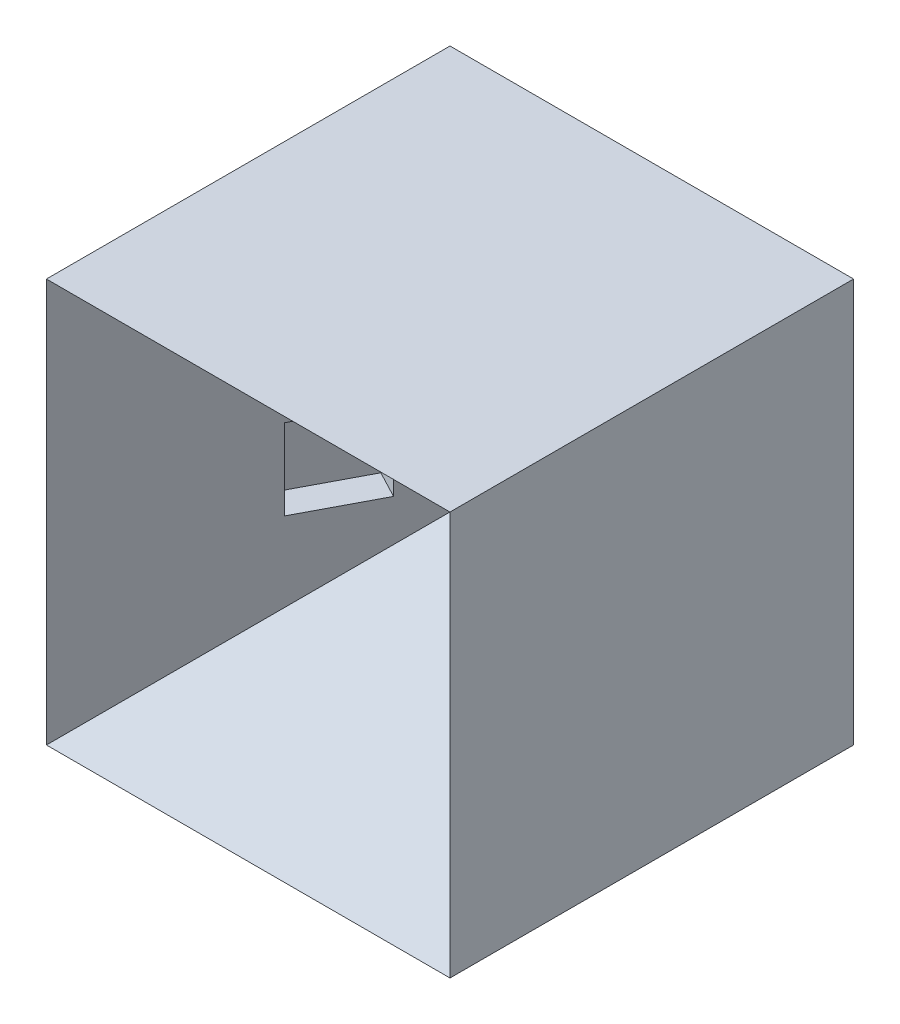
ISO-10303-21;
HEADER;
FILE_DESCRIPTION(('STEP AP214'),'2;1');
FILE_NAME('part.step','',(''),(''),'','','');
FILE_SCHEMA(('AUTOMOTIVE_DESIGN { 1 0 10303 214 1 1 1 1 }'));
ENDSEC;
DATA;
#1=APPLICATION_CONTEXT('core data for automotive mechanical design processes');
#2=APPLICATION_PROTOCOL_DEFINITION('international standard','automotive_design',2000,#1);
#3=PRODUCT_CONTEXT('',#1,'mechanical');
#4=PRODUCT('Part','Part','',(#3));
#5=PRODUCT_RELATED_PRODUCT_CATEGORY('part','',(#4));
#6=PRODUCT_DEFINITION_FORMATION('','',#4);
#7=PRODUCT_DEFINITION_CONTEXT('part definition',#1,'design');
#8=PRODUCT_DEFINITION('design','',#6,#7);
#9=PRODUCT_DEFINITION_SHAPE('','',#8);
#10=(LENGTH_UNIT() NAMED_UNIT(*) SI_UNIT(.MILLI.,.METRE.));
#11=(NAMED_UNIT(*) PLANE_ANGLE_UNIT() SI_UNIT($,.RADIAN.));
#12=(NAMED_UNIT(*) SI_UNIT($,.STERADIAN.) SOLID_ANGLE_UNIT());
#13=UNCERTAINTY_MEASURE_WITH_UNIT(LENGTH_MEASURE(1.E-05),#10,'distance_accuracy_value','');
#14=(GEOMETRIC_REPRESENTATION_CONTEXT(3) GLOBAL_UNCERTAINTY_ASSIGNED_CONTEXT((#13)) GLOBAL_UNIT_ASSIGNED_CONTEXT((#10,
#11,#12)) REPRESENTATION_CONTEXT('',''));
#15=CARTESIAN_POINT('',(0.,0.,0.));
#16=DIRECTION('',(0.,0.,1.));
#17=DIRECTION('',(1.,0.,0.));
#18=AXIS2_PLACEMENT_3D('',#15,#16,#17);
#19=CARTESIAN_POINT('',(-0.824295010845989,0.,-7.11034732023495));
#20=DIRECTION('',(0.884918222381982,0.,-0.465746432832622));
#21=DIRECTION('',(-0.465746432832622,0.,-0.884918222381982));
#22=AXIS2_PLACEMENT_3D('',#19,#20,#21);
#23=PLANE('',#22);
#24=DIRECTION('',(-0.422200330920749,0.422200330920749,-0.802180628749423));
#25=VECTOR('',#24,1.);
#26=CARTESIAN_POINT('',(20.,-20.,32.4558132003724));
#27=LINE('',#26,#25);
#28=CARTESIAN_POINT('',(20.,-20.,32.4558132003724));
#29=VERTEX_POINT('',#28);
#30=CARTESIAN_POINT('',(0.,0.,-5.54418679962758));
#31=VERTEX_POINT('',#30);
#32=EDGE_CURVE('E219',#29,#31,#27,.T.);
#33=ORIENTED_EDGE('',*,*,#32,.F.);
#34=CARTESIAN_POINT('',(20.,-20.,32.4558132003724));
#35=DIRECTION('',(0.,1.,0.));
#36=VECTOR('',#35,1.);
#37=LINE('',#34,#36);
#38=CARTESIAN_POINT('',(20.,20.,32.4558132003724));
#39=VERTEX_POINT('',#38);
#40=EDGE_CURVE('E213',#29,#39,#37,.T.);
#41=ORIENTED_EDGE('',*,*,#40,.T.);
#42=DIRECTION('',(-0.422200330920749,-0.422200330920749,-0.802180628749423));
#43=VECTOR('',#42,1.);
#44=CARTESIAN_POINT('',(20.,20.,32.4558132003724));
#45=LINE('',#44,#43);
#46=EDGE_CURVE('E203',#39,#31,#45,.T.);
#47=ORIENTED_EDGE('',*,*,#46,.T.);
#48=EDGE_LOOP('',(#33,#41,#47));
#49=FACE_BOUND('',#48,.T.);
#50=DIRECTION('',(0.,-1.,0.));
#51=VECTOR('',#50,1.);
#52=CARTESIAN_POINT('',(11.8629857313305,-4.,16.9954860899003));
#53=LINE('',#52,#51);
#54=CARTESIAN_POINT('',(11.8629857313305,4.,16.9954860899003));
#55=VERTEX_POINT('',#54);
#56=CARTESIAN_POINT('',(11.8629857313305,-4.,16.9954860899003));
#57=VERTEX_POINT('',#56);
#58=EDGE_CURVE('E63',#55,#57,#53,.T.);
#59=ORIENTED_EDGE('',*,*,#58,.T.);
#60=DIRECTION('',(-0.465746432832622,0.,-0.884918222381982));
#61=VECTOR('',#60,1.);
#62=CARTESIAN_POINT('',(8.13701426866951,-4.,9.91614031084449));
#63=LINE('',#62,#61);
#64=CARTESIAN_POINT('',(8.13701426866951,-4.,9.91614031084449));
#65=VERTEX_POINT('',#64);
#66=EDGE_CURVE('E160',#57,#65,#63,.T.);
#67=ORIENTED_EDGE('',*,*,#66,.T.);
#68=DIRECTION('',(0.,1.,0.));
#69=VECTOR('',#68,1.);
#70=CARTESIAN_POINT('',(8.13701426866951,-4.,9.91614031084449));
#71=LINE('',#70,#69);
#72=CARTESIAN_POINT('',(8.13701426866951,4.,9.91614031084449));
#73=VERTEX_POINT('',#72);
#74=EDGE_CURVE('E163',#65,#73,#71,.T.);
#75=ORIENTED_EDGE('',*,*,#74,.T.);
#76=DIRECTION('',(0.465746432832622,0.,0.884918222381982));
#77=VECTOR('',#76,1.);
#78=CARTESIAN_POINT('',(8.13701426866951,4.,9.91614031084449));
#79=LINE('',#78,#77);
#80=EDGE_CURVE('E169',#73,#55,#79,.T.);
#81=ORIENTED_EDGE('',*,*,#80,.T.);
#82=EDGE_LOOP('',(#59,#67,#75,#81));
#83=FACE_BOUND('',#82,.T.);
#84=ADVANCED_FACE('F44',(#49,#83),#23,.F.);
#85=CARTESIAN_POINT('',(-20.,-20.,32.4558132003724));
#86=DIRECTION('',(1.,0.,0.));
#87=DIRECTION('',(0.,0.,-1.));
#88=AXIS2_PLACEMENT_3D('',#85,#86,#87);
#89=PLANE('',#88);
#90=DIRECTION('',(0.,-1.,0.));
#91=VECTOR('',#90,1.);
#92=CARTESIAN_POINT('',(-20.,-20.,-7.54418679962758));
#93=LINE('',#92,#91);
#94=CARTESIAN_POINT('',(-20.,20.,-7.54418679962758));
#95=VERTEX_POINT('',#94);
#96=CARTESIAN_POINT('',(-20.,-20.,-7.54418679962758));
#97=VERTEX_POINT('',#96);
#98=EDGE_CURVE('E256',#95,#97,#93,.T.);
#99=ORIENTED_EDGE('',*,*,#98,.T.);
#100=DIRECTION('',(0.,0.,-1.));
#101=VECTOR('',#100,1.);
#102=CARTESIAN_POINT('',(-20.,-20.,32.4558132003724));
#103=LINE('',#102,#101);
#104=CARTESIAN_POINT('',(-20.,-20.,32.4558132003724));
#105=VERTEX_POINT('',#104);
#106=EDGE_CURVE('E12',#105,#97,#103,.T.);
#107=ORIENTED_EDGE('',*,*,#106,.F.);
#108=CARTESIAN_POINT('',(-20.,20.,32.4558132003724));
#109=DIRECTION('',(0.,-1.,0.));
#110=VECTOR('',#109,1.);
#111=LINE('',#108,#110);
#112=CARTESIAN_POINT('',(-20.,20.,32.4558132003724));
#113=VERTEX_POINT('',#112);
#114=EDGE_CURVE('E262',#113,#105,#111,.T.);
#115=ORIENTED_EDGE('',*,*,#114,.F.);
#116=DIRECTION('',(0.,0.,-1.));
#117=VECTOR('',#116,1.);
#118=CARTESIAN_POINT('',(-20.,20.,32.4558132003724));
#119=LINE('',#118,#117);
#120=EDGE_CURVE('E498',#113,#95,#119,.T.);
#121=ORIENTED_EDGE('',*,*,#120,.T.);
#122=EDGE_LOOP('',(#99,#107,#115,#121));
#123=FACE_BOUND('',#122,.T.);
#124=ADVANCED_FACE('F46',(#123),#89,.F.);
#125=CARTESIAN_POINT('',(20.,-20.,32.4558132003724));
#126=DIRECTION('',(0.,1.,0.));
#127=DIRECTION('',(-1.,0.,0.));
#128=AXIS2_PLACEMENT_3D('',#125,#126,#127);
#129=PLANE('',#128);
#130=DIRECTION('',(1.,0.,0.));
#131=VECTOR('',#130,1.);
#132=CARTESIAN_POINT('',(20.,-20.,-7.54418679962758));
#133=LINE('',#132,#131);
#134=CARTESIAN_POINT('',(20.,-20.,-7.54418679962758));
#135=VERTEX_POINT('',#134);
#136=EDGE_CURVE('E500',#97,#135,#133,.T.);
#137=ORIENTED_EDGE('',*,*,#136,.T.);
#138=DIRECTION('',(0.,0.,-1.));
#139=VECTOR('',#138,1.);
#140=CARTESIAN_POINT('',(20.,-20.,32.4558132003724));
#141=LINE('',#140,#139);
#142=EDGE_CURVE('E55',#29,#135,#141,.T.);
#143=ORIENTED_EDGE('',*,*,#142,.F.);
#144=CARTESIAN_POINT('',(-20.,-20.,32.4558132003724));
#145=DIRECTION('',(1.,0.,0.));
#146=VECTOR('',#145,1.);
#147=LINE('',#144,#146);
#148=EDGE_CURVE('E512',#105,#29,#147,.T.);
#149=ORIENTED_EDGE('',*,*,#148,.F.);
#150=ORIENTED_EDGE('',*,*,#106,.T.);
#151=EDGE_LOOP('',(#137,#143,#149,#150));
#152=FACE_BOUND('',#151,.T.);
#153=ADVANCED_FACE('F398',(#152),#129,.F.);
#154=CARTESIAN_POINT('',(20.,-20.,32.4558132003724));
#155=DIRECTION('',(-1.,0.,0.));
#156=DIRECTION('',(0.,0.,1.));
#157=AXIS2_PLACEMENT_3D('',#154,#155,#156);
#158=PLANE('',#157);
#159=DIRECTION('',(0.,1.,0.));
#160=VECTOR('',#159,1.);
#161=CARTESIAN_POINT('',(20.,-20.,-7.54418679962758));
#162=LINE('',#161,#160);
#163=CARTESIAN_POINT('',(20.,20.,-7.54418679962758));
#164=VERTEX_POINT('',#163);
#165=EDGE_CURVE('E501',#135,#164,#162,.T.);
#166=ORIENTED_EDGE('',*,*,#165,.T.);
#167=DIRECTION('',(0.,0.,-1.));
#168=VECTOR('',#167,1.);
#169=CARTESIAN_POINT('',(20.,20.,32.4558132003724));
#170=LINE('',#169,#168);
#171=EDGE_CURVE('E530',#39,#164,#170,.T.);
#172=ORIENTED_EDGE('',*,*,#171,.F.);
#173=ORIENTED_EDGE('',*,*,#40,.F.);
#174=ORIENTED_EDGE('',*,*,#142,.T.);
#175=EDGE_LOOP('',(#166,#172,#173,#174));
#176=FACE_BOUND('',#175,.T.);
#177=ADVANCED_FACE('F391',(#176),#158,.F.);
#178=CARTESIAN_POINT('',(20.,20.,32.4558132003724));
#179=DIRECTION('',(0.,-1.,0.));
#180=DIRECTION('',(1.,0.,0.));
#181=AXIS2_PLACEMENT_3D('',#178,#179,#180);
#182=PLANE('',#181);
#183=DIRECTION('',(-1.,0.,0.));
#184=VECTOR('',#183,1.);
#185=CARTESIAN_POINT('',(20.,20.,-7.54418679962758));
#186=LINE('',#185,#184);
#187=EDGE_CURVE('E504',#164,#95,#186,.T.);
#188=ORIENTED_EDGE('',*,*,#187,.T.);
#189=ORIENTED_EDGE('',*,*,#120,.F.);
#190=CARTESIAN_POINT('',(20.,20.,32.4558132003724));
#191=DIRECTION('',(-1.,0.,0.));
#192=VECTOR('',#191,1.);
#193=LINE('',#190,#192);
#194=EDGE_CURVE('E280',#39,#113,#193,.T.);
#195=ORIENTED_EDGE('',*,*,#194,.F.);
#196=ORIENTED_EDGE('',*,*,#171,.T.);
#197=EDGE_LOOP('',(#188,#189,#195,#196));
#198=FACE_BOUND('',#197,.T.);
#199=ADVANCED_FACE('F384',(#198),#182,.F.);
#200=CARTESIAN_POINT('',(0.,0.,-7.54418679962758));
#201=DIRECTION('',(0.,0.,1.));
#202=DIRECTION('',(1.,0.,0.));
#203=AXIS2_PLACEMENT_3D('',#200,#201,#202);
#204=PLANE('',#203);
#205=ORIENTED_EDGE('',*,*,#98,.F.);
#206=ORIENTED_EDGE('',*,*,#187,.F.);
#207=ORIENTED_EDGE('',*,*,#165,.F.);
#208=ORIENTED_EDGE('',*,*,#136,.F.);
#209=EDGE_LOOP('',(#205,#206,#207,#208));
#210=FACE_BOUND('',#209,.T.);
#211=ADVANCED_FACE('F239',(#210),#204,.F.);
#212=CARTESIAN_POINT('',(0.,-0.824295010845988,-7.11034732023495));
#213=DIRECTION('',(0.,0.884918222381982,-0.465746432832622));
#214=DIRECTION('',(0.,0.465746432832622,0.884918222381982));
#215=AXIS2_PLACEMENT_3D('',#212,#213,#214);
#216=PLANE('',#215);
#217=ORIENTED_EDGE('',*,*,#46,.F.);
#218=ORIENTED_EDGE('',*,*,#194,.T.);
#219=DIRECTION('',(0.422200330920749,-0.422200330920749,-0.802180628749423));
#220=VECTOR('',#219,1.);
#221=CARTESIAN_POINT('',(-20.,20.,32.4558132003724));
#222=LINE('',#221,#220);
#223=EDGE_CURVE('E267',#113,#31,#222,.T.);
#224=ORIENTED_EDGE('',*,*,#223,.T.);
#225=EDGE_LOOP('',(#217,#218,#224));
#226=FACE_BOUND('',#225,.T.);
#227=ADVANCED_FACE('F286',(#226),#216,.F.);
#228=CARTESIAN_POINT('',(0.824295010845989,0.,-7.11034732023495));
#229=DIRECTION('',(-0.884918222381982,0.,-0.465746432832622));
#230=DIRECTION('',(-0.465746432832622,0.,0.884918222381982));
#231=AXIS2_PLACEMENT_3D('',#228,#229,#230);
#232=PLANE('',#231);
#233=DIRECTION('',(0.465746432832622,0.,-0.884918222381982));
#234=VECTOR('',#233,1.);
#235=CARTESIAN_POINT('',(-8.13701426866951,-4.,9.91614031084449));
#236=LINE('',#235,#234);
#237=CARTESIAN_POINT('',(-11.8629857313305,-4.,16.9954860899003));
#238=VERTEX_POINT('',#237);
#239=CARTESIAN_POINT('',(-8.13701426866951,-4.,9.91614031084449));
#240=VERTEX_POINT('',#239);
#241=EDGE_CURVE('E193',#238,#240,#236,.T.);
#242=ORIENTED_EDGE('',*,*,#241,.F.);
#243=DIRECTION('',(0.,-1.,0.));
#244=VECTOR('',#243,1.);
#245=CARTESIAN_POINT('',(-11.8629857313305,-4.,16.9954860899003));
#246=LINE('',#245,#244);
#247=CARTESIAN_POINT('',(-11.8629857313305,4.,16.9954860899003));
#248=VERTEX_POINT('',#247);
#249=EDGE_CURVE('E71',#248,#238,#246,.T.);
#250=ORIENTED_EDGE('',*,*,#249,.F.);
#251=DIRECTION('',(-0.465746432832622,0.,0.884918222381982));
#252=VECTOR('',#251,1.);
#253=CARTESIAN_POINT('',(-8.13701426866951,4.,9.91614031084449));
#254=LINE('',#253,#252);
#255=CARTESIAN_POINT('',(-8.13701426866951,4.,9.91614031084449));
#256=VERTEX_POINT('',#255);
#257=EDGE_CURVE('E182',#256,#248,#254,.T.);
#258=ORIENTED_EDGE('',*,*,#257,.F.);
#259=DIRECTION('',(0.,1.,0.));
#260=VECTOR('',#259,1.);
#261=CARTESIAN_POINT('',(-8.13701426866951,-4.,9.91614031084449));
#262=LINE('',#261,#260);
#263=EDGE_CURVE('E196',#240,#256,#262,.T.);
#264=ORIENTED_EDGE('',*,*,#263,.F.);
#265=EDGE_LOOP('',(#242,#250,#258,#264));
#266=FACE_BOUND('',#265,.T.);
#267=ORIENTED_EDGE('',*,*,#223,.F.);
#268=ORIENTED_EDGE('',*,*,#114,.T.);
#269=DIRECTION('',(0.422200330920749,0.422200330920749,-0.802180628749423));
#270=VECTOR('',#269,1.);
#271=CARTESIAN_POINT('',(-20.,-20.,32.4558132003724));
#272=LINE('',#271,#270);
#273=EDGE_CURVE('E248',#105,#31,#272,.T.);
#274=ORIENTED_EDGE('',*,*,#273,.T.);
#275=EDGE_LOOP('',(#267,#268,#274));
#276=FACE_BOUND('',#275,.T.);
#277=ADVANCED_FACE('F230',(#266,#276),#232,.F.);
#278=CARTESIAN_POINT('',(0.,0.824295010845987,-7.11034732023496));
#279=DIRECTION('',(0.,-0.884918222381982,-0.465746432832622));
#280=DIRECTION('',(0.,0.465746432832622,-0.884918222381982));
#281=AXIS2_PLACEMENT_3D('',#278,#279,#280);
#282=PLANE('',#281);
#283=ORIENTED_EDGE('',*,*,#273,.F.);
#284=ORIENTED_EDGE('',*,*,#148,.T.);
#285=ORIENTED_EDGE('',*,*,#32,.T.);
#286=EDGE_LOOP('',(#283,#284,#285));
#287=FACE_BOUND('',#286,.T.);
#288=ADVANCED_FACE('F233',(#287),#282,.F.);
#289=CARTESIAN_POINT('',(-14.5177403984764,-4.,15.5982467914025));
#290=DIRECTION('',(-0.465746432832622,0.,0.884918222381982));
#291=DIRECTION('',(0.884918222381982,0.,0.465746432832622));
#292=AXIS2_PLACEMENT_3D('',#289,#290,#291);
#293=PLANE('',#292);
#294=ORIENTED_EDGE('',*,*,#249,.T.);
#295=DIRECTION('',(0.884918222381982,0.,0.465746432832622));
#296=VECTOR('',#295,1.);
#297=CARTESIAN_POINT('',(-14.5177403984764,-4.,15.5982467914025));
#298=LINE('',#297,#296);
#299=CARTESIAN_POINT('',(-14.5177403984764,-4.,15.5982467914025));
#300=VERTEX_POINT('',#299);
#301=EDGE_CURVE('E191',#300,#238,#298,.T.);
#302=ORIENTED_EDGE('',*,*,#301,.F.);
#303=DIRECTION('',(0.,-1.,0.));
#304=VECTOR('',#303,1.);
#305=CARTESIAN_POINT('',(-14.5177403984764,-4.,15.5982467914025));
#306=LINE('',#305,#304);
#307=CARTESIAN_POINT('',(-14.5177403984764,4.,15.5982467914025));
#308=VERTEX_POINT('',#307);
#309=EDGE_CURVE('E178',#308,#300,#306,.T.);
#310=ORIENTED_EDGE('',*,*,#309,.F.);
#311=DIRECTION('',(0.884918222381982,0.,0.465746432832622));
#312=VECTOR('',#311,1.);
#313=CARTESIAN_POINT('',(-14.5177403984764,4.,15.5982467914025));
#314=LINE('',#313,#312);
#315=EDGE_CURVE('E201',#308,#248,#314,.T.);
#316=ORIENTED_EDGE('',*,*,#315,.T.);
#317=EDGE_LOOP('',(#294,#302,#310,#316));
#318=FACE_BOUND('',#317,.T.);
#319=ADVANCED_FACE('F237',(#318),#293,.F.);
#320=CARTESIAN_POINT('',(-10.7917689358155,4.,8.51890101234663));
#321=DIRECTION('',(0.,1.,0.));
#322=DIRECTION('',(0.,0.,1.));
#323=AXIS2_PLACEMENT_3D('',#320,#321,#322);
#324=PLANE('',#323);
#325=ORIENTED_EDGE('',*,*,#257,.T.);
#326=ORIENTED_EDGE('',*,*,#315,.F.);
#327=DIRECTION('',(-0.465746432832622,0.,0.884918222381982));
#328=VECTOR('',#327,1.);
#329=CARTESIAN_POINT('',(-10.7917689358155,4.,8.51890101234663));
#330=LINE('',#329,#328);
#331=CARTESIAN_POINT('',(-10.7917689358155,4.,8.51890101234663));
#332=VERTEX_POINT('',#331);
#333=EDGE_CURVE('E188',#332,#308,#330,.T.);
#334=ORIENTED_EDGE('',*,*,#333,.F.);
#335=DIRECTION('',(0.884918222381982,0.,0.465746432832622));
#336=VECTOR('',#335,1.);
#337=CARTESIAN_POINT('',(-10.7917689358155,4.,8.51890101234663));
#338=LINE('',#337,#336);
#339=EDGE_CURVE('E204',#332,#256,#338,.T.);
#340=ORIENTED_EDGE('',*,*,#339,.T.);
#341=EDGE_LOOP('',(#325,#326,#334,#340));
#342=FACE_BOUND('',#341,.T.);
#343=ADVANCED_FACE('F297',(#342),#324,.F.);
#344=CARTESIAN_POINT('',(-10.7917689358155,-4.,8.51890101234663));
#345=DIRECTION('',(0.465746432832622,0.,-0.884918222381982));
#346=DIRECTION('',(-0.884918222381982,0.,-0.465746432832622));
#347=AXIS2_PLACEMENT_3D('',#344,#345,#346);
#348=PLANE('',#347);
#349=ORIENTED_EDGE('',*,*,#263,.T.);
#350=ORIENTED_EDGE('',*,*,#339,.F.);
#351=DIRECTION('',(0.,1.,0.));
#352=VECTOR('',#351,1.);
#353=CARTESIAN_POINT('',(-10.7917689358155,-4.,8.51890101234663));
#354=LINE('',#353,#352);
#355=CARTESIAN_POINT('',(-10.7917689358155,-4.,8.51890101234663));
#356=VERTEX_POINT('',#355);
#357=EDGE_CURVE('E185',#356,#332,#354,.T.);
#358=ORIENTED_EDGE('',*,*,#357,.F.);
#359=DIRECTION('',(0.884918222381982,0.,0.465746432832622));
#360=VECTOR('',#359,1.);
#361=CARTESIAN_POINT('',(-10.7917689358155,-4.,8.51890101234663));
#362=LINE('',#361,#360);
#363=EDGE_CURVE('E206',#356,#240,#362,.T.);
#364=ORIENTED_EDGE('',*,*,#363,.T.);
#365=EDGE_LOOP('',(#349,#350,#358,#364));
#366=FACE_BOUND('',#365,.T.);
#367=ADVANCED_FACE('F302',(#366),#348,.F.);
#368=CARTESIAN_POINT('',(-10.7917689358155,-4.,8.51890101234663));
#369=DIRECTION('',(0.,-1.,0.));
#370=DIRECTION('',(0.,0.,-1.));
#371=AXIS2_PLACEMENT_3D('',#368,#369,#370);
#372=PLANE('',#371);
#373=ORIENTED_EDGE('',*,*,#241,.T.);
#374=ORIENTED_EDGE('',*,*,#363,.F.);
#375=DIRECTION('',(0.465746432832622,0.,-0.884918222381982));
#376=VECTOR('',#375,1.);
#377=CARTESIAN_POINT('',(-10.7917689358155,-4.,8.51890101234663));
#378=LINE('',#377,#376);
#379=EDGE_CURVE('E181',#300,#356,#378,.T.);
#380=ORIENTED_EDGE('',*,*,#379,.F.);
#381=ORIENTED_EDGE('',*,*,#301,.T.);
#382=EDGE_LOOP('',(#373,#374,#380,#381));
#383=FACE_BOUND('',#382,.T.);
#384=ADVANCED_FACE('F298',(#383),#372,.F.);
#385=CARTESIAN_POINT('',(-1.83045965629996,0.,-8.50758661873282));
#386=DIRECTION('',(0.884918222381982,0.,0.465746432832622));
#387=DIRECTION('',(0.465746432832622,0.,-0.884918222381982));
#388=AXIS2_PLACEMENT_3D('',#385,#386,#387);
#389=PLANE('',#388);
#390=ORIENTED_EDGE('',*,*,#309,.T.);
#391=ORIENTED_EDGE('',*,*,#379,.T.);
#392=ORIENTED_EDGE('',*,*,#357,.T.);
#393=ORIENTED_EDGE('',*,*,#333,.T.);
#394=EDGE_LOOP('',(#390,#391,#392,#393));
#395=FACE_BOUND('',#394,.T.);
#396=ADVANCED_FACE('F301',(#395),#389,.T.);
#397=CARTESIAN_POINT('',(14.5177403984764,-4.,15.5982467914025));
#398=DIRECTION('',(-0.465746432832622,0.,-0.884918222381982));
#399=DIRECTION('',(-0.884918222381982,0.,0.465746432832622));
#400=AXIS2_PLACEMENT_3D('',#397,#398,#399);
#401=PLANE('',#400);
#402=ORIENTED_EDGE('',*,*,#58,.F.);
#403=DIRECTION('',(-0.884918222381982,0.,0.465746432832622));
#404=VECTOR('',#403,1.);
#405=CARTESIAN_POINT('',(14.5177403984764,4.,15.5982467914025));
#406=LINE('',#405,#404);
#407=CARTESIAN_POINT('',(14.5177403984764,4.,15.5982467914025));
#408=VERTEX_POINT('',#407);
#409=EDGE_CURVE('E145',#408,#55,#406,.T.);
#410=ORIENTED_EDGE('',*,*,#409,.F.);
#411=DIRECTION('',(0.,-1.,0.));
#412=VECTOR('',#411,1.);
#413=CARTESIAN_POINT('',(14.5177403984764,-4.,15.5982467914025));
#414=LINE('',#413,#412);
#415=CARTESIAN_POINT('',(14.5177403984764,-4.,15.5982467914025));
#416=VERTEX_POINT('',#415);
#417=EDGE_CURVE('E152',#408,#416,#414,.T.);
#418=ORIENTED_EDGE('',*,*,#417,.T.);
#419=DIRECTION('',(-0.884918222381982,0.,0.465746432832622));
#420=VECTOR('',#419,1.);
#421=CARTESIAN_POINT('',(14.5177403984764,-4.,15.5982467914025));
#422=LINE('',#421,#420);
#423=EDGE_CURVE('E173',#416,#57,#422,.T.);
#424=ORIENTED_EDGE('',*,*,#423,.T.);
#425=EDGE_LOOP('',(#402,#410,#418,#424));
#426=FACE_BOUND('',#425,.T.);
#427=ADVANCED_FACE('F155',(#426),#401,.T.);
#428=CARTESIAN_POINT('',(10.7917689358155,-4.,8.51890101234663));
#429=DIRECTION('',(0.,1.,0.));
#430=DIRECTION('',(0.,0.,1.));
#431=AXIS2_PLACEMENT_3D('',#428,#429,#430);
#432=PLANE('',#431);
#433=ORIENTED_EDGE('',*,*,#66,.F.);
#434=ORIENTED_EDGE('',*,*,#423,.F.);
#435=DIRECTION('',(-0.465746432832622,0.,-0.884918222381982));
#436=VECTOR('',#435,1.);
#437=CARTESIAN_POINT('',(10.7917689358155,-4.,8.51890101234663));
#438=LINE('',#437,#436);
#439=CARTESIAN_POINT('',(10.7917689358155,-4.,8.51890101234663));
#440=VERTEX_POINT('',#439);
#441=EDGE_CURVE('E157',#416,#440,#438,.T.);
#442=ORIENTED_EDGE('',*,*,#441,.T.);
#443=DIRECTION('',(-0.884918222381982,0.,0.465746432832622));
#444=VECTOR('',#443,1.);
#445=CARTESIAN_POINT('',(10.7917689358155,-4.,8.51890101234663));
#446=LINE('',#445,#444);
#447=EDGE_CURVE('E175',#440,#65,#446,.T.);
#448=ORIENTED_EDGE('',*,*,#447,.T.);
#449=EDGE_LOOP('',(#433,#434,#442,#448));
#450=FACE_BOUND('',#449,.T.);
#451=ADVANCED_FACE('F315',(#450),#432,.T.);
#452=CARTESIAN_POINT('',(10.7917689358155,-4.,8.51890101234663));
#453=DIRECTION('',(0.465746432832622,0.,0.884918222381982));
#454=DIRECTION('',(0.884918222381982,0.,-0.465746432832622));
#455=AXIS2_PLACEMENT_3D('',#452,#453,#454);
#456=PLANE('',#455);
#457=ORIENTED_EDGE('',*,*,#74,.F.);
#458=ORIENTED_EDGE('',*,*,#447,.F.);
#459=DIRECTION('',(0.,1.,0.));
#460=VECTOR('',#459,1.);
#461=CARTESIAN_POINT('',(10.7917689358155,-4.,8.51890101234663));
#462=LINE('',#461,#460);
#463=CARTESIAN_POINT('',(10.7917689358155,4.,8.51890101234663));
#464=VERTEX_POINT('',#463);
#465=EDGE_CURVE('E151',#440,#464,#462,.T.);
#466=ORIENTED_EDGE('',*,*,#465,.T.);
#467=DIRECTION('',(-0.884918222381982,0.,0.465746432832622));
#468=VECTOR('',#467,1.);
#469=CARTESIAN_POINT('',(10.7917689358155,4.,8.51890101234663));
#470=LINE('',#469,#468);
#471=EDGE_CURVE('E147',#464,#73,#470,.T.);
#472=ORIENTED_EDGE('',*,*,#471,.T.);
#473=EDGE_LOOP('',(#457,#458,#466,#472));
#474=FACE_BOUND('',#473,.T.);
#475=ADVANCED_FACE('F318',(#474),#456,.T.);
#476=CARTESIAN_POINT('',(10.7917689358155,4.,8.51890101234663));
#477=DIRECTION('',(0.,-1.,0.));
#478=DIRECTION('',(0.,0.,-1.));
#479=AXIS2_PLACEMENT_3D('',#476,#477,#478);
#480=PLANE('',#479);
#481=ORIENTED_EDGE('',*,*,#80,.F.);
#482=ORIENTED_EDGE('',*,*,#471,.F.);
#483=DIRECTION('',(0.465746432832622,0.,0.884918222381982));
#484=VECTOR('',#483,1.);
#485=CARTESIAN_POINT('',(10.7917689358155,4.,8.51890101234663));
#486=LINE('',#485,#484);
#487=EDGE_CURVE('E142',#464,#408,#486,.T.);
#488=ORIENTED_EDGE('',*,*,#487,.T.);
#489=ORIENTED_EDGE('',*,*,#409,.T.);
#490=EDGE_LOOP('',(#481,#482,#488,#489));
#491=FACE_BOUND('',#490,.T.);
#492=ADVANCED_FACE('F144',(#491),#480,.T.);
#493=CARTESIAN_POINT('',(1.83045965629996,0.,-8.50758661873282));
#494=DIRECTION('',(-0.884918222381982,0.,0.465746432832622));
#495=DIRECTION('',(-0.465746432832622,0.,-0.884918222381982));
#496=AXIS2_PLACEMENT_3D('',#493,#494,#495);
#497=PLANE('',#496);
#498=ORIENTED_EDGE('',*,*,#417,.F.);
#499=ORIENTED_EDGE('',*,*,#487,.F.);
#500=ORIENTED_EDGE('',*,*,#465,.F.);
#501=ORIENTED_EDGE('',*,*,#441,.F.);
#502=EDGE_LOOP('',(#498,#499,#500,#501));
#503=FACE_BOUND('',#502,.T.);
#504=ADVANCED_FACE('F159',(#503),#497,.T.);
#505=CLOSED_SHELL('',(#84,#124,#153,#177,#199,#211,#227,#277,#288,#319,#343,#367,#384,#396,#427,
#451,#475,#492,#504));
#506=MANIFOLD_SOLID_BREP('B2',#505);
#507=ADVANCED_BREP_SHAPE_REPRESENTATION('',(#18,#506),#14);
#508=SHAPE_DEFINITION_REPRESENTATION(#9,#507);
ENDSEC;
END-ISO-10303-21;
